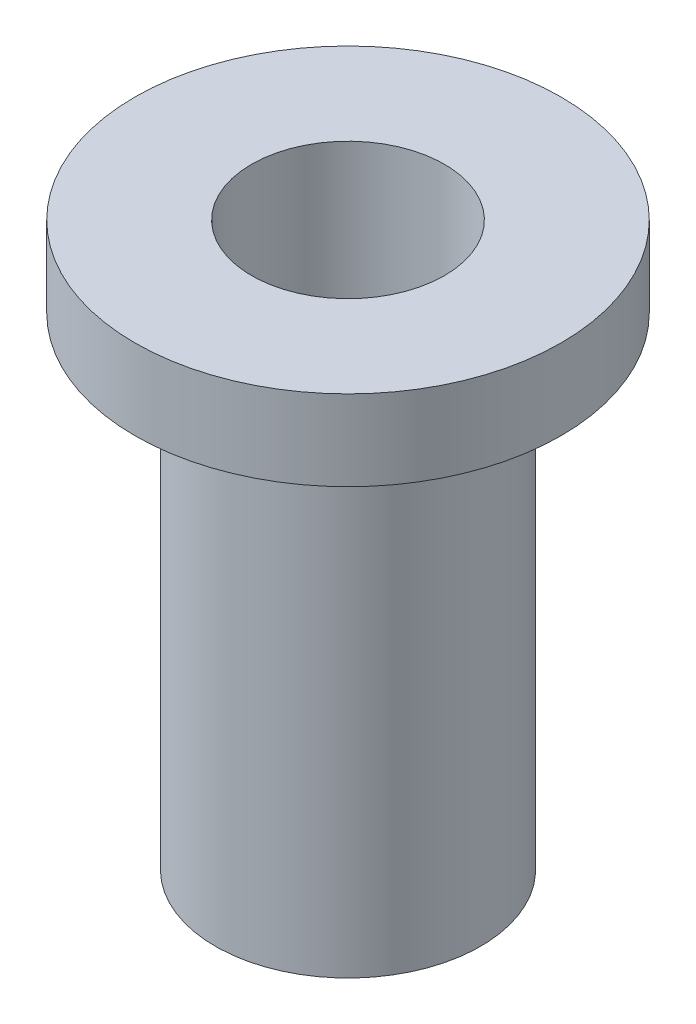
ISO-10303-21;
HEADER;
FILE_DESCRIPTION(('STEP AP214'),'2;1');
FILE_NAME('part.step','',(''),(''),'','','');
FILE_SCHEMA(('AUTOMOTIVE_DESIGN { 1 0 10303 214 1 1 1 1 }'));
ENDSEC;
DATA;
#1=APPLICATION_CONTEXT('core data for automotive mechanical design processes');
#2=APPLICATION_PROTOCOL_DEFINITION('international standard','automotive_design',2000,#1);
#3=PRODUCT_CONTEXT('',#1,'mechanical');
#4=PRODUCT('Part','Part','',(#3));
#5=PRODUCT_RELATED_PRODUCT_CATEGORY('part','',(#4));
#6=PRODUCT_DEFINITION_FORMATION('','',#4);
#7=PRODUCT_DEFINITION_CONTEXT('part definition',#1,'design');
#8=PRODUCT_DEFINITION('design','',#6,#7);
#9=PRODUCT_DEFINITION_SHAPE('','',#8);
#10=(LENGTH_UNIT() NAMED_UNIT(*) SI_UNIT(.MILLI.,.METRE.));
#11=(NAMED_UNIT(*) PLANE_ANGLE_UNIT() SI_UNIT($,.RADIAN.));
#12=(NAMED_UNIT(*) SI_UNIT($,.STERADIAN.) SOLID_ANGLE_UNIT());
#13=UNCERTAINTY_MEASURE_WITH_UNIT(LENGTH_MEASURE(1.E-05),#10,'distance_accuracy_value','');
#14=(GEOMETRIC_REPRESENTATION_CONTEXT(3) GLOBAL_UNCERTAINTY_ASSIGNED_CONTEXT((#13)) GLOBAL_UNIT_ASSIGNED_CONTEXT((#10,
#11,#12)) REPRESENTATION_CONTEXT('',''));
#15=CARTESIAN_POINT('',(0.,0.,0.));
#16=DIRECTION('',(0.,0.,1.));
#17=DIRECTION('',(1.,0.,0.));
#18=AXIS2_PLACEMENT_3D('',#15,#16,#17);
#19=CARTESIAN_POINT('',(-1.65000000000001,0.,0.));
#20=DIRECTION('',(0.,-1.,0.));
#21=DIRECTION('',(1.,0.,0.));
#22=AXIS2_PLACEMENT_3D('',#19,#20,#21);
#23=PLANE('',#22);
#24=CARTESIAN_POINT('',(0.,0.,0.));
#25=DIRECTION('',(0.,1.,0.));
#26=DIRECTION('',(-1.,0.,0.));
#27=AXIS2_PLACEMENT_3D('',#24,#25,#26);
#28=CIRCLE('',#27,1.65000000000001);
#29=CARTESIAN_POINT('',(-1.65000000000001,0.,0.));
#30=VERTEX_POINT('',#29);
#31=EDGE_CURVE('E46',#30,#30,#28,.T.);
#32=ORIENTED_EDGE('',*,*,#31,.T.);
#33=EDGE_LOOP('',(#32));
#34=FACE_BOUND('',#33,.T.);
#35=CARTESIAN_POINT('',(0.,0.,0.));
#36=DIRECTION('',(0.,1.,0.));
#37=DIRECTION('',(-1.,0.,0.));
#38=AXIS2_PLACEMENT_3D('',#35,#36,#37);
#39=CIRCLE('',#38,2.65000000000001);
#40=CARTESIAN_POINT('',(-2.65000000000001,0.,0.));
#41=VERTEX_POINT('',#40);
#42=EDGE_CURVE('E11',#41,#41,#39,.T.);
#43=ORIENTED_EDGE('',*,*,#42,.F.);
#44=EDGE_LOOP('',(#43));
#45=FACE_BOUND('',#44,.T.);
#46=ADVANCED_FACE('F32',(#34,#45),#23,.T.);
#47=CARTESIAN_POINT('',(0.,2.,0.));
#48=DIRECTION('',(0.,1.,0.));
#49=DIRECTION('',(-1.,0.,0.));
#50=AXIS2_PLACEMENT_3D('',#47,#48,#49);
#51=CYLINDRICAL_SURFACE('',#50,2.65000000000001);
#52=ORIENTED_EDGE('',*,*,#42,.T.);
#53=EDGE_LOOP('',(#52));
#54=FACE_BOUND('',#53,.T.);
#55=CARTESIAN_POINT('',(0.,1.,0.));
#56=DIRECTION('',(0.,1.,0.));
#57=DIRECTION('',(-1.,0.,0.));
#58=AXIS2_PLACEMENT_3D('',#55,#56,#57);
#59=CIRCLE('',#58,2.65000000000001);
#60=CARTESIAN_POINT('',(-2.65000000000001,1.,0.));
#61=VERTEX_POINT('',#60);
#62=EDGE_CURVE('E38',#61,#61,#59,.T.);
#63=ORIENTED_EDGE('',*,*,#62,.F.);
#64=EDGE_LOOP('',(#63));
#65=FACE_BOUND('',#64,.T.);
#66=ADVANCED_FACE('F64',(#54,#65),#51,.T.);
#67=CARTESIAN_POINT('',(-2.65000000000001,1.,0.));
#68=DIRECTION('',(0.,1.,0.));
#69=DIRECTION('',(-1.,0.,0.));
#70=AXIS2_PLACEMENT_3D('',#67,#68,#69);
#71=PLANE('',#70);
#72=CARTESIAN_POINT('',(0.,1.,0.));
#73=DIRECTION('',(0.,1.,0.));
#74=DIRECTION('',(-1.,0.,0.));
#75=AXIS2_PLACEMENT_3D('',#72,#73,#74);
#76=CIRCLE('',#75,1.2);
#77=CARTESIAN_POINT('',(-1.2,1.,0.));
#78=VERTEX_POINT('',#77);
#79=EDGE_CURVE('E54',#78,#78,#76,.T.);
#80=ORIENTED_EDGE('',*,*,#79,.F.);
#81=EDGE_LOOP('',(#80));
#82=FACE_BOUND('',#81,.T.);
#83=ORIENTED_EDGE('',*,*,#62,.T.);
#84=EDGE_LOOP('',(#83));
#85=FACE_BOUND('',#84,.T.);
#86=ADVANCED_FACE('F61',(#82,#85),#71,.T.);
#87=CARTESIAN_POINT('',(-1.65,-6.,0.));
#88=DIRECTION('',(0.,-1.,0.));
#89=DIRECTION('',(1.,0.,0.));
#90=AXIS2_PLACEMENT_3D('',#87,#88,#89);
#91=PLANE('',#90);
#92=CARTESIAN_POINT('',(0.,-6.,0.));
#93=DIRECTION('',(0.,1.,0.));
#94=DIRECTION('',(-1.,0.,0.));
#95=AXIS2_PLACEMENT_3D('',#92,#93,#94);
#96=CIRCLE('',#95,1.65);
#97=CARTESIAN_POINT('',(-1.65,-6.,0.));
#98=VERTEX_POINT('',#97);
#99=EDGE_CURVE('E42',#98,#98,#96,.T.);
#100=ORIENTED_EDGE('',*,*,#99,.F.);
#101=EDGE_LOOP('',(#100));
#102=FACE_BOUND('',#101,.T.);
#103=ADVANCED_FACE('F63',(#102),#91,.T.);
#104=CARTESIAN_POINT('',(0.,2.,0.));
#105=DIRECTION('',(0.,1.,0.));
#106=DIRECTION('',(-1.,0.,0.));
#107=AXIS2_PLACEMENT_3D('',#104,#105,#106);
#108=CYLINDRICAL_SURFACE('',#107,1.65);
#109=ORIENTED_EDGE('',*,*,#99,.T.);
#110=EDGE_LOOP('',(#109));
#111=FACE_BOUND('',#110,.T.);
#112=ORIENTED_EDGE('',*,*,#31,.F.);
#113=EDGE_LOOP('',(#112));
#114=FACE_BOUND('',#113,.T.);
#115=ADVANCED_FACE('F70',(#111,#114),#108,.T.);
#116=CARTESIAN_POINT('',(-1.65,-4.8,0.));
#117=DIRECTION('',(0.,-1.,0.));
#118=DIRECTION('',(1.,0.,0.));
#119=AXIS2_PLACEMENT_3D('',#116,#117,#118);
#120=PLANE('',#119);
#121=CARTESIAN_POINT('',(0.,-4.8,0.));
#122=DIRECTION('',(0.,-1.,0.));
#123=DIRECTION('',(1.,0.,0.));
#124=AXIS2_PLACEMENT_3D('',#121,#122,#123);
#125=CIRCLE('',#124,1.2);
#126=CARTESIAN_POINT('',(1.2,-4.8,0.));
#127=VERTEX_POINT('',#126);
#128=EDGE_CURVE('E51',#127,#127,#125,.F.);
#129=ORIENTED_EDGE('',*,*,#128,.T.);
#130=EDGE_LOOP('',(#129));
#131=FACE_BOUND('',#130,.T.);
#132=ADVANCED_FACE('F81',(#131),#120,.F.);
#133=CARTESIAN_POINT('',(0.,-9.39411254969543,0.));
#134=DIRECTION('',(0.,1.,0.));
#135=DIRECTION('',(-1.,0.,0.));
#136=AXIS2_PLACEMENT_3D('',#133,#134,#135);
#137=CYLINDRICAL_SURFACE('',#136,1.2);
#138=ORIENTED_EDGE('',*,*,#79,.T.);
#139=EDGE_LOOP('',(#138));
#140=FACE_BOUND('',#139,.T.);
#141=ORIENTED_EDGE('',*,*,#128,.F.);
#142=EDGE_LOOP('',(#141));
#143=FACE_BOUND('',#142,.T.);
#144=ADVANCED_FACE('F58',(#140,#143),#137,.F.);
#145=CLOSED_SHELL('',(#46,#66,#86,#103,#115,#132,#144));
#146=MANIFOLD_SOLID_BREP('B2',#145);
#147=ADVANCED_BREP_SHAPE_REPRESENTATION('',(#18,#146),#14);
#148=SHAPE_DEFINITION_REPRESENTATION(#9,#147);
ENDSEC;
END-ISO-10303-21;
